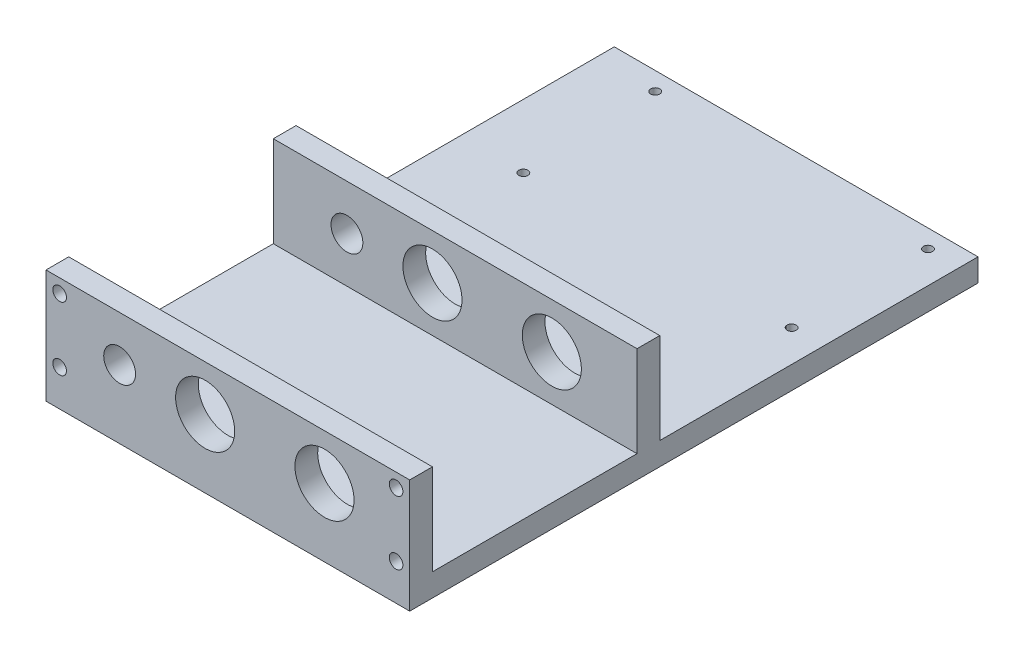
ISO-10303-21;
HEADER;
FILE_DESCRIPTION(('STEP AP214'),'2;1');
FILE_NAME('part.step','',(''),(''),'','','');
FILE_SCHEMA(('AUTOMOTIVE_DESIGN { 1 0 10303 214 1 1 1 1 }'));
ENDSEC;
DATA;
#1=APPLICATION_CONTEXT('core data for automotive mechanical design processes');
#2=APPLICATION_PROTOCOL_DEFINITION('international standard','automotive_design',2000,#1);
#3=PRODUCT_CONTEXT('',#1,'mechanical');
#4=PRODUCT('Part','Part','',(#3));
#5=PRODUCT_RELATED_PRODUCT_CATEGORY('part','',(#4));
#6=PRODUCT_DEFINITION_FORMATION('','',#4);
#7=PRODUCT_DEFINITION_CONTEXT('part definition',#1,'design');
#8=PRODUCT_DEFINITION('design','',#6,#7);
#9=PRODUCT_DEFINITION_SHAPE('','',#8);
#10=(LENGTH_UNIT() NAMED_UNIT(*) SI_UNIT(.MILLI.,.METRE.));
#11=(NAMED_UNIT(*) PLANE_ANGLE_UNIT() SI_UNIT($,.RADIAN.));
#12=(NAMED_UNIT(*) SI_UNIT($,.STERADIAN.) SOLID_ANGLE_UNIT());
#13=UNCERTAINTY_MEASURE_WITH_UNIT(LENGTH_MEASURE(1.E-05),#10,'distance_accuracy_value','');
#14=(GEOMETRIC_REPRESENTATION_CONTEXT(3) GLOBAL_UNCERTAINTY_ASSIGNED_CONTEXT((#13)) GLOBAL_UNIT_ASSIGNED_CONTEXT((#10,
#11,#12)) REPRESENTATION_CONTEXT('',''));
#15=CARTESIAN_POINT('',(0.,0.,0.));
#16=DIRECTION('',(0.,0.,1.));
#17=DIRECTION('',(1.,0.,0.));
#18=AXIS2_PLACEMENT_3D('',#15,#16,#17);
#19=CARTESIAN_POINT('',(80.,5.,-120.));
#20=DIRECTION('',(0.,-1.,0.));
#21=DIRECTION('',(0.,0.,-1.));
#22=AXIS2_PLACEMENT_3D('',#19,#20,#21);
#23=PLANE('',#22);
#24=CARTESIAN_POINT('',(13.,5.,-116.));
#25=DIRECTION('',(0.,1.,0.));
#26=DIRECTION('',(0.,0.,1.));
#27=AXIS2_PLACEMENT_3D('',#24,#25,#26);
#28=CIRCLE('',#27,1.);
#29=CARTESIAN_POINT('',(13.,5.,-115.));
#30=VERTEX_POINT('',#29);
#31=EDGE_CURVE('E463',#30,#30,#28,.T.);
#32=ORIENTED_EDGE('',*,*,#31,.F.);
#33=EDGE_LOOP('',(#32));
#34=FACE_BOUND('',#33,.T.);
#35=CARTESIAN_POINT('',(14.,5.,-86.));
#36=DIRECTION('',(0.,1.,0.));
#37=DIRECTION('',(0.,0.,1.));
#38=AXIS2_PLACEMENT_3D('',#35,#36,#37);
#39=CIRCLE('',#38,1.);
#40=CARTESIAN_POINT('',(14.,5.,-85.));
#41=VERTEX_POINT('',#40);
#42=EDGE_CURVE('E464',#41,#41,#39,.T.);
#43=ORIENTED_EDGE('',*,*,#42,.F.);
#44=EDGE_LOOP('',(#43));
#45=FACE_BOUND('',#44,.T.);
#46=CARTESIAN_POINT('',(73.,5.,-86.));
#47=DIRECTION('',(0.,1.,0.));
#48=DIRECTION('',(0.,0.,1.));
#49=AXIS2_PLACEMENT_3D('',#46,#47,#48);
#50=CIRCLE('',#49,0.999999999999998);
#51=CARTESIAN_POINT('',(73.,5.,-85.));
#52=VERTEX_POINT('',#51);
#53=EDGE_CURVE('E466',#52,#52,#50,.T.);
#54=ORIENTED_EDGE('',*,*,#53,.F.);
#55=EDGE_LOOP('',(#54));
#56=FACE_BOUND('',#55,.T.);
#57=CARTESIAN_POINT('',(73.,5.,-116.));
#58=DIRECTION('',(0.,1.,0.));
#59=DIRECTION('',(0.,0.,1.));
#60=AXIS2_PLACEMENT_3D('',#57,#58,#59);
#61=CIRCLE('',#60,0.999999999999998);
#62=CARTESIAN_POINT('',(73.,5.,-115.));
#63=VERTEX_POINT('',#62);
#64=EDGE_CURVE('E201',#63,#63,#61,.T.);
#65=ORIENTED_EDGE('',*,*,#64,.F.);
#66=EDGE_LOOP('',(#65));
#67=FACE_BOUND('',#66,.T.);
#68=DIRECTION('',(-1.,0.,0.));
#69=VECTOR('',#68,1.);
#70=CARTESIAN_POINT('',(80.,5.,-50.));
#71=LINE('',#70,#69);
#72=CARTESIAN_POINT('',(80.,5.,-50.));
#73=VERTEX_POINT('',#72);
#74=CARTESIAN_POINT('',(0.,5.,-50.));
#75=VERTEX_POINT('',#74);
#76=EDGE_CURVE('E259',#73,#75,#71,.T.);
#77=ORIENTED_EDGE('',*,*,#76,.F.);
#78=DIRECTION('',(0.,0.,1.));
#79=VECTOR('',#78,1.);
#80=CARTESIAN_POINT('',(80.,5.,-120.));
#81=LINE('',#80,#79);
#82=CARTESIAN_POINT('',(80.,5.,-120.));
#83=VERTEX_POINT('',#82);
#84=EDGE_CURVE('E136',#83,#73,#81,.T.);
#85=ORIENTED_EDGE('',*,*,#84,.F.);
#86=DIRECTION('',(1.,0.,0.));
#87=VECTOR('',#86,1.);
#88=CARTESIAN_POINT('',(80.,5.,-120.));
#89=LINE('',#88,#87);
#90=CARTESIAN_POINT('',(0.,5.,-120.));
#91=VERTEX_POINT('',#90);
#92=EDGE_CURVE('E153',#91,#83,#89,.T.);
#93=ORIENTED_EDGE('',*,*,#92,.F.);
#94=DIRECTION('',(0.,0.,1.));
#95=VECTOR('',#94,1.);
#96=CARTESIAN_POINT('',(0.,5.,-120.));
#97=LINE('',#96,#95);
#98=EDGE_CURVE('E58',#91,#75,#97,.T.);
#99=ORIENTED_EDGE('',*,*,#98,.T.);
#100=EDGE_LOOP('',(#77,#85,#93,#99));
#101=FACE_BOUND('',#100,.T.);
#102=ADVANCED_FACE('F33',(#34,#45,#56,#67,#101),#23,.F.);
#103=DIRECTION('',(1.,0.,0.));
#104=VECTOR('',#103,1.);
#105=CARTESIAN_POINT('',(0.,5.,-45.));
#106=LINE('',#105,#104);
#107=CARTESIAN_POINT('',(0.,5.,-45.));
#108=VERTEX_POINT('',#107);
#109=CARTESIAN_POINT('',(80.,5.,-45.));
#110=VERTEX_POINT('',#109);
#111=EDGE_CURVE('E50',#108,#110,#106,.T.);
#112=ORIENTED_EDGE('',*,*,#111,.F.);
#113=CARTESIAN_POINT('',(0.,5.,0.));
#114=VERTEX_POINT('',#113);
#115=EDGE_CURVE('E157',#108,#114,#97,.T.);
#116=ORIENTED_EDGE('',*,*,#115,.T.);
#117=DIRECTION('',(1.,0.,0.));
#118=VECTOR('',#117,1.);
#119=CARTESIAN_POINT('',(80.,5.,0.));
#120=LINE('',#119,#118);
#121=CARTESIAN_POINT('',(80.,5.,0.));
#122=VERTEX_POINT('',#121);
#123=EDGE_CURVE('E137',#114,#122,#120,.T.);
#124=ORIENTED_EDGE('',*,*,#123,.T.);
#125=EDGE_CURVE('E154',#110,#122,#81,.T.);
#126=ORIENTED_EDGE('',*,*,#125,.F.);
#127=EDGE_LOOP('',(#112,#116,#124,#126));
#128=FACE_BOUND('',#127,.T.);
#129=ADVANCED_FACE('F273',(#128),#23,.F.);
#130=CARTESIAN_POINT('',(0.,0.,5.));
#131=DIRECTION('',(1.,0.,0.));
#132=DIRECTION('',(0.,0.,-1.));
#133=AXIS2_PLACEMENT_3D('',#130,#131,#132);
#134=PLANE('',#133);
#135=DIRECTION('',(0.,-1.,0.));
#136=VECTOR('',#135,1.);
#137=CARTESIAN_POINT('',(0.,0.,0.));
#138=LINE('',#137,#136);
#139=CARTESIAN_POINT('',(0.,25.,0.));
#140=VERTEX_POINT('',#139);
#141=EDGE_CURVE('E159',#140,#114,#138,.T.);
#142=ORIENTED_EDGE('',*,*,#141,.T.);
#143=ORIENTED_EDGE('',*,*,#115,.F.);
#144=DIRECTION('',(0.,-1.,0.));
#145=VECTOR('',#144,1.);
#146=CARTESIAN_POINT('',(0.,25.,-45.));
#147=LINE('',#146,#145);
#148=CARTESIAN_POINT('',(0.,25.,-45.));
#149=VERTEX_POINT('',#148);
#150=EDGE_CURVE('E142',#149,#108,#147,.T.);
#151=ORIENTED_EDGE('',*,*,#150,.F.);
#152=DIRECTION('',(0.,0.,1.));
#153=VECTOR('',#152,1.);
#154=CARTESIAN_POINT('',(0.,25.,-50.));
#155=LINE('',#154,#153);
#156=CARTESIAN_POINT('',(0.,25.,-50.));
#157=VERTEX_POINT('',#156);
#158=EDGE_CURVE('E121',#157,#149,#155,.T.);
#159=ORIENTED_EDGE('',*,*,#158,.F.);
#160=DIRECTION('',(0.,-1.,0.));
#161=VECTOR('',#160,1.);
#162=CARTESIAN_POINT('',(0.,25.,-50.));
#163=LINE('',#162,#161);
#164=EDGE_CURVE('E118',#157,#75,#163,.T.);
#165=ORIENTED_EDGE('',*,*,#164,.T.);
#166=ORIENTED_EDGE('',*,*,#98,.F.);
#167=DIRECTION('',(0.,1.,0.));
#168=VECTOR('',#167,1.);
#169=CARTESIAN_POINT('',(0.,5.,-120.));
#170=LINE('',#169,#168);
#171=CARTESIAN_POINT('',(0.,0.,-120.));
#172=VERTEX_POINT('',#171);
#173=EDGE_CURVE('E151',#172,#91,#170,.T.);
#174=ORIENTED_EDGE('',*,*,#173,.F.);
#175=DIRECTION('',(0.,0.,-1.));
#176=VECTOR('',#175,1.);
#177=CARTESIAN_POINT('',(0.,0.,5.));
#178=LINE('',#177,#176);
#179=CARTESIAN_POINT('',(0.,0.,5.));
#180=VERTEX_POINT('',#179);
#181=EDGE_CURVE('E11',#180,#172,#178,.T.);
#182=ORIENTED_EDGE('',*,*,#181,.F.);
#183=DIRECTION('',(0.,-1.,0.));
#184=VECTOR('',#183,1.);
#185=CARTESIAN_POINT('',(0.,0.,5.));
#186=LINE('',#185,#184);
#187=CARTESIAN_POINT('',(0.,25.,5.));
#188=VERTEX_POINT('',#187);
#189=EDGE_CURVE('E160',#188,#180,#186,.T.);
#190=ORIENTED_EDGE('',*,*,#189,.F.);
#191=DIRECTION('',(0.,0.,-1.));
#192=VECTOR('',#191,1.);
#193=CARTESIAN_POINT('',(0.,25.,5.));
#194=LINE('',#193,#192);
#195=EDGE_CURVE('E170',#188,#140,#194,.T.);
#196=ORIENTED_EDGE('',*,*,#195,.T.);
#197=EDGE_LOOP('',(#142,#143,#151,#159,#165,#166,#174,#182,#190,#196));
#198=FACE_BOUND('',#197,.T.);
#199=ADVANCED_FACE('F35',(#198),#134,.F.);
#200=CARTESIAN_POINT('',(0.,0.,5.));
#201=DIRECTION('',(0.,1.,0.));
#202=DIRECTION('',(0.,0.,1.));
#203=AXIS2_PLACEMENT_3D('',#200,#201,#202);
#204=PLANE('',#203);
#205=CARTESIAN_POINT('',(13.,0.,-116.));
#206=DIRECTION('',(0.,1.,0.));
#207=DIRECTION('',(0.,0.,1.));
#208=AXIS2_PLACEMENT_3D('',#205,#206,#207);
#209=CIRCLE('',#208,1.);
#210=CARTESIAN_POINT('',(13.,0.,-115.));
#211=VERTEX_POINT('',#210);
#212=EDGE_CURVE('E37',#211,#211,#209,.T.);
#213=ORIENTED_EDGE('',*,*,#212,.T.);
#214=EDGE_LOOP('',(#213));
#215=FACE_BOUND('',#214,.T.);
#216=CARTESIAN_POINT('',(14.,0.,-86.));
#217=DIRECTION('',(0.,1.,0.));
#218=DIRECTION('',(0.,0.,1.));
#219=AXIS2_PLACEMENT_3D('',#216,#217,#218);
#220=CIRCLE('',#219,1.);
#221=CARTESIAN_POINT('',(14.,0.,-85.));
#222=VERTEX_POINT('',#221);
#223=EDGE_CURVE('E203',#222,#222,#220,.T.);
#224=ORIENTED_EDGE('',*,*,#223,.T.);
#225=EDGE_LOOP('',(#224));
#226=FACE_BOUND('',#225,.T.);
#227=CARTESIAN_POINT('',(73.,0.,-86.));
#228=DIRECTION('',(0.,1.,0.));
#229=DIRECTION('',(0.,0.,1.));
#230=AXIS2_PLACEMENT_3D('',#227,#228,#229);
#231=CIRCLE('',#230,0.999999999999998);
#232=CARTESIAN_POINT('',(73.,0.,-85.));
#233=VERTEX_POINT('',#232);
#234=EDGE_CURVE('E200',#233,#233,#231,.T.);
#235=ORIENTED_EDGE('',*,*,#234,.T.);
#236=EDGE_LOOP('',(#235));
#237=FACE_BOUND('',#236,.T.);
#238=CARTESIAN_POINT('',(73.,0.,-116.));
#239=DIRECTION('',(0.,1.,0.));
#240=DIRECTION('',(0.,0.,1.));
#241=AXIS2_PLACEMENT_3D('',#238,#239,#240);
#242=CIRCLE('',#241,0.999999999999998);
#243=CARTESIAN_POINT('',(73.,0.,-115.));
#244=VERTEX_POINT('',#243);
#245=EDGE_CURVE('E197',#244,#244,#242,.T.);
#246=ORIENTED_EDGE('',*,*,#245,.T.);
#247=EDGE_LOOP('',(#246));
#248=FACE_BOUND('',#247,.T.);
#249=ORIENTED_EDGE('',*,*,#181,.T.);
#250=DIRECTION('',(-1.,0.,0.));
#251=VECTOR('',#250,1.);
#252=CARTESIAN_POINT('',(80.,0.,-120.));
#253=LINE('',#252,#251);
#254=CARTESIAN_POINT('',(80.,0.,-120.));
#255=VERTEX_POINT('',#254);
#256=EDGE_CURVE('E148',#255,#172,#253,.T.);
#257=ORIENTED_EDGE('',*,*,#256,.F.);
#258=DIRECTION('',(0.,0.,-1.));
#259=VECTOR('',#258,1.);
#260=CARTESIAN_POINT('',(80.,0.,5.));
#261=LINE('',#260,#259);
#262=CARTESIAN_POINT('',(80.,0.,5.));
#263=VERTEX_POINT('',#262);
#264=EDGE_CURVE('E42',#263,#255,#261,.T.);
#265=ORIENTED_EDGE('',*,*,#264,.F.);
#266=DIRECTION('',(1.,0.,0.));
#267=VECTOR('',#266,1.);
#268=CARTESIAN_POINT('',(0.,0.,5.));
#269=LINE('',#268,#267);
#270=EDGE_CURVE('E163',#180,#263,#269,.T.);
#271=ORIENTED_EDGE('',*,*,#270,.F.);
#272=EDGE_LOOP('',(#249,#257,#265,#271));
#273=FACE_BOUND('',#272,.T.);
#274=ADVANCED_FACE('F291',(#215,#226,#237,#248,#273),#204,.F.);
#275=CARTESIAN_POINT('',(80.,0.,5.));
#276=DIRECTION('',(-1.,0.,0.));
#277=DIRECTION('',(0.,0.,1.));
#278=AXIS2_PLACEMENT_3D('',#275,#276,#277);
#279=PLANE('',#278);
#280=ORIENTED_EDGE('',*,*,#264,.T.);
#281=DIRECTION('',(0.,-1.,0.));
#282=VECTOR('',#281,1.);
#283=CARTESIAN_POINT('',(80.,5.,-120.));
#284=LINE('',#283,#282);
#285=EDGE_CURVE('E140',#83,#255,#284,.T.);
#286=ORIENTED_EDGE('',*,*,#285,.F.);
#287=ORIENTED_EDGE('',*,*,#84,.T.);
#288=DIRECTION('',(0.,-1.,0.));
#289=VECTOR('',#288,1.);
#290=CARTESIAN_POINT('',(80.,25.,-50.));
#291=LINE('',#290,#289);
#292=CARTESIAN_POINT('',(80.,25.,-50.));
#293=VERTEX_POINT('',#292);
#294=EDGE_CURVE('E116',#293,#73,#291,.T.);
#295=ORIENTED_EDGE('',*,*,#294,.F.);
#296=DIRECTION('',(0.,0.,-1.));
#297=VECTOR('',#296,1.);
#298=CARTESIAN_POINT('',(80.,25.,-45.));
#299=LINE('',#298,#297);
#300=CARTESIAN_POINT('',(80.,25.,-45.));
#301=VERTEX_POINT('',#300);
#302=EDGE_CURVE('E122',#301,#293,#299,.T.);
#303=ORIENTED_EDGE('',*,*,#302,.F.);
#304=DIRECTION('',(0.,-1.,0.));
#305=VECTOR('',#304,1.);
#306=CARTESIAN_POINT('',(80.,25.,-45.));
#307=LINE('',#306,#305);
#308=EDGE_CURVE('E263',#301,#110,#307,.T.);
#309=ORIENTED_EDGE('',*,*,#308,.T.);
#310=ORIENTED_EDGE('',*,*,#125,.T.);
#311=DIRECTION('',(0.,1.,0.));
#312=VECTOR('',#311,1.);
#313=CARTESIAN_POINT('',(80.,0.,0.));
#314=LINE('',#313,#312);
#315=CARTESIAN_POINT('',(80.,25.,0.));
#316=VERTEX_POINT('',#315);
#317=EDGE_CURVE('E173',#122,#316,#314,.T.);
#318=ORIENTED_EDGE('',*,*,#317,.T.);
#319=DIRECTION('',(0.,0.,-1.));
#320=VECTOR('',#319,1.);
#321=CARTESIAN_POINT('',(80.,25.,5.));
#322=LINE('',#321,#320);
#323=CARTESIAN_POINT('',(80.,25.,5.));
#324=VERTEX_POINT('',#323);
#325=EDGE_CURVE('E178',#324,#316,#322,.T.);
#326=ORIENTED_EDGE('',*,*,#325,.F.);
#327=DIRECTION('',(0.,1.,0.));
#328=VECTOR('',#327,1.);
#329=CARTESIAN_POINT('',(80.,0.,5.));
#330=LINE('',#329,#328);
#331=EDGE_CURVE('E166',#263,#324,#330,.T.);
#332=ORIENTED_EDGE('',*,*,#331,.F.);
#333=EDGE_LOOP('',(#280,#286,#287,#295,#303,#309,#310,#318,#326,#332));
#334=FACE_BOUND('',#333,.T.);
#335=ADVANCED_FACE('F133',(#334),#279,.F.);
#336=CARTESIAN_POINT('',(0.,25.,5.));
#337=DIRECTION('',(0.,-1.,0.));
#338=DIRECTION('',(0.,0.,-1.));
#339=AXIS2_PLACEMENT_3D('',#336,#337,#338);
#340=PLANE('',#339);
#341=DIRECTION('',(-1.,0.,0.));
#342=VECTOR('',#341,1.);
#343=CARTESIAN_POINT('',(0.,25.,0.));
#344=LINE('',#343,#342);
#345=EDGE_CURVE('E164',#316,#140,#344,.T.);
#346=ORIENTED_EDGE('',*,*,#345,.T.);
#347=ORIENTED_EDGE('',*,*,#195,.F.);
#348=DIRECTION('',(-1.,0.,0.));
#349=VECTOR('',#348,1.);
#350=CARTESIAN_POINT('',(0.,25.,5.));
#351=LINE('',#350,#349);
#352=EDGE_CURVE('E168',#324,#188,#351,.T.);
#353=ORIENTED_EDGE('',*,*,#352,.F.);
#354=ORIENTED_EDGE('',*,*,#325,.T.);
#355=EDGE_LOOP('',(#346,#347,#353,#354));
#356=FACE_BOUND('',#355,.T.);
#357=ADVANCED_FACE('F282',(#356),#340,.F.);
#358=CARTESIAN_POINT('',(0.,0.,5.));
#359=DIRECTION('',(0.,0.,-1.));
#360=DIRECTION('',(-1.,0.,0.));
#361=AXIS2_PLACEMENT_3D('',#358,#359,#360);
#362=PLANE('',#361);
#363=CARTESIAN_POINT('',(16.1918061123885,15.,5.));
#364=DIRECTION('',(0.,0.,-1.));
#365=DIRECTION('',(-1.,0.,0.));
#366=AXIS2_PLACEMENT_3D('',#363,#364,#365);
#367=CIRCLE('',#366,3.5);
#368=CARTESIAN_POINT('',(12.6918061123885,15.,5.));
#369=VERTEX_POINT('',#368);
#370=EDGE_CURVE('E196',#369,#369,#367,.T.);
#371=ORIENTED_EDGE('',*,*,#370,.T.);
#372=EDGE_LOOP('',(#371));
#373=FACE_BOUND('',#372,.T.);
#374=CARTESIAN_POINT('',(61.2583245324458,15.,5.));
#375=DIRECTION('',(0.,0.,-1.));
#376=DIRECTION('',(-1.,0.,0.));
#377=AXIS2_PLACEMENT_3D('',#374,#375,#376);
#378=CIRCLE('',#377,6.5);
#379=CARTESIAN_POINT('',(54.7583245324458,15.,5.));
#380=VERTEX_POINT('',#379);
#381=EDGE_CURVE('E186',#380,#380,#378,.T.);
#382=ORIENTED_EDGE('',*,*,#381,.T.);
#383=EDGE_LOOP('',(#382));
#384=FACE_BOUND('',#383,.T.);
#385=CARTESIAN_POINT('',(35.004725497032,15.,5.));
#386=DIRECTION('',(0.,0.,-1.));
#387=DIRECTION('',(-1.,0.,0.));
#388=AXIS2_PLACEMENT_3D('',#385,#386,#387);
#389=CIRCLE('',#388,6.5);
#390=CARTESIAN_POINT('',(28.504725497032,15.,5.));
#391=VERTEX_POINT('',#390);
#392=EDGE_CURVE('E222',#391,#391,#389,.T.);
#393=ORIENTED_EDGE('',*,*,#392,.T.);
#394=EDGE_LOOP('',(#393));
#395=FACE_BOUND('',#394,.T.);
#396=CARTESIAN_POINT('',(77.,8.,5.));
#397=DIRECTION('',(0.,0.,-1.));
#398=DIRECTION('',(-1.,0.,0.));
#399=AXIS2_PLACEMENT_3D('',#396,#397,#398);
#400=CIRCLE('',#399,1.5);
#401=CARTESIAN_POINT('',(75.5,8.,5.));
#402=VERTEX_POINT('',#401);
#403=EDGE_CURVE('E257',#402,#402,#400,.T.);
#404=ORIENTED_EDGE('',*,*,#403,.T.);
#405=EDGE_LOOP('',(#404));
#406=FACE_BOUND('',#405,.T.);
#407=CARTESIAN_POINT('',(3.,22.,5.));
#408=DIRECTION('',(0.,0.,-1.));
#409=DIRECTION('',(-1.,0.,0.));
#410=AXIS2_PLACEMENT_3D('',#407,#408,#409);
#411=CIRCLE('',#410,1.5);
#412=CARTESIAN_POINT('',(1.50000000000001,22.,5.));
#413=VERTEX_POINT('',#412);
#414=EDGE_CURVE('E254',#413,#413,#411,.T.);
#415=ORIENTED_EDGE('',*,*,#414,.T.);
#416=EDGE_LOOP('',(#415));
#417=FACE_BOUND('',#416,.T.);
#418=CARTESIAN_POINT('',(3.,8.,5.));
#419=DIRECTION('',(0.,0.,-1.));
#420=DIRECTION('',(-1.,0.,0.));
#421=AXIS2_PLACEMENT_3D('',#418,#419,#420);
#422=CIRCLE('',#421,1.5);
#423=CARTESIAN_POINT('',(1.50000000000001,8.,5.));
#424=VERTEX_POINT('',#423);
#425=EDGE_CURVE('E251',#424,#424,#422,.T.);
#426=ORIENTED_EDGE('',*,*,#425,.T.);
#427=EDGE_LOOP('',(#426));
#428=FACE_BOUND('',#427,.T.);
#429=CARTESIAN_POINT('',(77.,22.,5.));
#430=DIRECTION('',(0.,0.,-1.));
#431=DIRECTION('',(-1.,0.,0.));
#432=AXIS2_PLACEMENT_3D('',#429,#430,#431);
#433=CIRCLE('',#432,1.5);
#434=CARTESIAN_POINT('',(75.5,22.,5.));
#435=VERTEX_POINT('',#434);
#436=EDGE_CURVE('E248',#435,#435,#433,.T.);
#437=ORIENTED_EDGE('',*,*,#436,.T.);
#438=EDGE_LOOP('',(#437));
#439=FACE_BOUND('',#438,.T.);
#440=ORIENTED_EDGE('',*,*,#189,.T.);
#441=ORIENTED_EDGE('',*,*,#270,.T.);
#442=ORIENTED_EDGE('',*,*,#331,.T.);
#443=ORIENTED_EDGE('',*,*,#352,.T.);
#444=EDGE_LOOP('',(#440,#441,#442,#443));
#445=FACE_BOUND('',#444,.T.);
#446=ADVANCED_FACE('F286',(#373,#384,#395,#406,#417,#428,#439,#445),#362,.F.);
#447=CARTESIAN_POINT('',(0.,0.,0.));
#448=DIRECTION('',(0.,0.,-1.));
#449=DIRECTION('',(-1.,0.,0.));
#450=AXIS2_PLACEMENT_3D('',#447,#448,#449);
#451=PLANE('',#450);
#452=CARTESIAN_POINT('',(16.1918061123885,15.,0.));
#453=DIRECTION('',(0.,0.,-1.));
#454=DIRECTION('',(-1.,0.,0.));
#455=AXIS2_PLACEMENT_3D('',#452,#453,#454);
#456=CIRCLE('',#455,3.5);
#457=CARTESIAN_POINT('',(12.6918061123885,15.,0.));
#458=VERTEX_POINT('',#457);
#459=EDGE_CURVE('E219',#458,#458,#456,.T.);
#460=ORIENTED_EDGE('',*,*,#459,.F.);
#461=EDGE_LOOP('',(#460));
#462=FACE_BOUND('',#461,.T.);
#463=CARTESIAN_POINT('',(61.2583245324458,15.,0.));
#464=DIRECTION('',(0.,0.,-1.));
#465=DIRECTION('',(-1.,0.,0.));
#466=AXIS2_PLACEMENT_3D('',#463,#464,#465);
#467=CIRCLE('',#466,6.5);
#468=CARTESIAN_POINT('',(54.7583245324458,15.,0.));
#469=VERTEX_POINT('',#468);
#470=EDGE_CURVE('E233',#469,#469,#467,.T.);
#471=ORIENTED_EDGE('',*,*,#470,.F.);
#472=EDGE_LOOP('',(#471));
#473=FACE_BOUND('',#472,.T.);
#474=CARTESIAN_POINT('',(35.004725497032,15.,0.));
#475=DIRECTION('',(0.,0.,-1.));
#476=DIRECTION('',(-1.,0.,0.));
#477=AXIS2_PLACEMENT_3D('',#474,#475,#476);
#478=CIRCLE('',#477,6.5);
#479=CARTESIAN_POINT('',(28.504725497032,15.,0.));
#480=VERTEX_POINT('',#479);
#481=EDGE_CURVE('E191',#480,#480,#478,.T.);
#482=ORIENTED_EDGE('',*,*,#481,.F.);
#483=EDGE_LOOP('',(#482));
#484=FACE_BOUND('',#483,.T.);
#485=CARTESIAN_POINT('',(77.,8.,0.));
#486=DIRECTION('',(0.,0.,-1.));
#487=DIRECTION('',(1.,0.,0.));
#488=AXIS2_PLACEMENT_3D('',#485,#486,#487);
#489=CIRCLE('',#488,1.5);
#490=CARTESIAN_POINT('',(78.5,8.,0.));
#491=VERTEX_POINT('',#490);
#492=EDGE_CURVE('E240',#491,#491,#489,.T.);
#493=ORIENTED_EDGE('',*,*,#492,.F.);
#494=EDGE_LOOP('',(#493));
#495=FACE_BOUND('',#494,.T.);
#496=CARTESIAN_POINT('',(3.,22.,0.));
#497=DIRECTION('',(0.,0.,-1.));
#498=DIRECTION('',(1.,0.,0.));
#499=AXIS2_PLACEMENT_3D('',#496,#497,#498);
#500=CIRCLE('',#499,1.5);
#501=CARTESIAN_POINT('',(4.5,22.,0.));
#502=VERTEX_POINT('',#501);
#503=EDGE_CURVE('E239',#502,#502,#500,.T.);
#504=ORIENTED_EDGE('',*,*,#503,.F.);
#505=EDGE_LOOP('',(#504));
#506=FACE_BOUND('',#505,.T.);
#507=CARTESIAN_POINT('',(3.,8.,0.));
#508=DIRECTION('',(0.,0.,-1.));
#509=DIRECTION('',(-1.,0.,0.));
#510=AXIS2_PLACEMENT_3D('',#507,#508,#509);
#511=CIRCLE('',#510,1.5);
#512=CARTESIAN_POINT('',(1.50000000000001,8.,0.));
#513=VERTEX_POINT('',#512);
#514=EDGE_CURVE('E236',#513,#513,#511,.T.);
#515=ORIENTED_EDGE('',*,*,#514,.F.);
#516=EDGE_LOOP('',(#515));
#517=FACE_BOUND('',#516,.T.);
#518=CARTESIAN_POINT('',(77.,22.,0.));
#519=DIRECTION('',(0.,0.,-1.));
#520=DIRECTION('',(-1.,0.,0.));
#521=AXIS2_PLACEMENT_3D('',#518,#519,#520);
#522=CIRCLE('',#521,1.5);
#523=CARTESIAN_POINT('',(75.5,22.,0.));
#524=VERTEX_POINT('',#523);
#525=EDGE_CURVE('E243',#524,#524,#522,.T.);
#526=ORIENTED_EDGE('',*,*,#525,.F.);
#527=EDGE_LOOP('',(#526));
#528=FACE_BOUND('',#527,.T.);
#529=ORIENTED_EDGE('',*,*,#123,.F.);
#530=ORIENTED_EDGE('',*,*,#141,.F.);
#531=ORIENTED_EDGE('',*,*,#345,.F.);
#532=ORIENTED_EDGE('',*,*,#317,.F.);
#533=EDGE_LOOP('',(#529,#530,#531,#532));
#534=FACE_BOUND('',#533,.T.);
#535=ADVANCED_FACE('F276',(#462,#473,#484,#495,#506,#517,#528,#534),#451,.T.);
#536=CARTESIAN_POINT('',(0.,0.,-120.));
#537=DIRECTION('',(0.,0.,-1.));
#538=DIRECTION('',(-1.,0.,0.));
#539=AXIS2_PLACEMENT_3D('',#536,#537,#538);
#540=PLANE('',#539);
#541=ORIENTED_EDGE('',*,*,#285,.T.);
#542=ORIENTED_EDGE('',*,*,#256,.T.);
#543=ORIENTED_EDGE('',*,*,#173,.T.);
#544=ORIENTED_EDGE('',*,*,#92,.T.);
#545=EDGE_LOOP('',(#541,#542,#543,#544));
#546=FACE_BOUND('',#545,.T.);
#547=ADVANCED_FACE('F294',(#546),#540,.T.);
#548=CARTESIAN_POINT('',(80.,25.,-50.));
#549=DIRECTION('',(0.,0.,1.));
#550=DIRECTION('',(1.,0.,0.));
#551=AXIS2_PLACEMENT_3D('',#548,#549,#550);
#552=PLANE('',#551);
#553=CARTESIAN_POINT('',(16.1918061123885,15.,-50.));
#554=DIRECTION('',(0.,0.,1.));
#555=DIRECTION('',(1.,0.,0.));
#556=AXIS2_PLACEMENT_3D('',#553,#554,#555);
#557=CIRCLE('',#556,3.5);
#558=CARTESIAN_POINT('',(19.6918061123885,15.,-50.));
#559=VERTEX_POINT('',#558);
#560=EDGE_CURVE('E195',#559,#559,#557,.T.);
#561=ORIENTED_EDGE('',*,*,#560,.T.);
#562=EDGE_LOOP('',(#561));
#563=FACE_BOUND('',#562,.T.);
#564=CARTESIAN_POINT('',(61.2583245324458,15.,-50.));
#565=DIRECTION('',(0.,0.,1.));
#566=DIRECTION('',(1.,0.,0.));
#567=AXIS2_PLACEMENT_3D('',#564,#565,#566);
#568=CIRCLE('',#567,6.5);
#569=CARTESIAN_POINT('',(67.7583245324458,15.,-50.));
#570=VERTEX_POINT('',#569);
#571=EDGE_CURVE('E190',#570,#570,#568,.T.);
#572=ORIENTED_EDGE('',*,*,#571,.T.);
#573=EDGE_LOOP('',(#572));
#574=FACE_BOUND('',#573,.T.);
#575=CARTESIAN_POINT('',(35.004725497032,15.,-50.));
#576=DIRECTION('',(0.,0.,1.));
#577=DIRECTION('',(1.,0.,0.));
#578=AXIS2_PLACEMENT_3D('',#575,#576,#577);
#579=CIRCLE('',#578,6.5);
#580=CARTESIAN_POINT('',(41.504725497032,15.,-50.));
#581=VERTEX_POINT('',#580);
#582=EDGE_CURVE('E185',#581,#581,#579,.T.);
#583=ORIENTED_EDGE('',*,*,#582,.T.);
#584=EDGE_LOOP('',(#583));
#585=FACE_BOUND('',#584,.T.);
#586=ORIENTED_EDGE('',*,*,#76,.T.);
#587=ORIENTED_EDGE('',*,*,#164,.F.);
#588=DIRECTION('',(-1.,0.,0.));
#589=VECTOR('',#588,1.);
#590=CARTESIAN_POINT('',(80.,25.,-50.));
#591=LINE('',#590,#589);
#592=EDGE_CURVE('E112',#293,#157,#591,.T.);
#593=ORIENTED_EDGE('',*,*,#592,.F.);
#594=ORIENTED_EDGE('',*,*,#294,.T.);
#595=EDGE_LOOP('',(#586,#587,#593,#594));
#596=FACE_BOUND('',#595,.T.);
#597=ADVANCED_FACE('F114',(#563,#574,#585,#596),#552,.F.);
#598=CARTESIAN_POINT('',(0.,25.,-45.));
#599=DIRECTION('',(0.,0.,-1.));
#600=DIRECTION('',(-1.,0.,0.));
#601=AXIS2_PLACEMENT_3D('',#598,#599,#600);
#602=PLANE('',#601);
#603=CARTESIAN_POINT('',(16.1918061123885,15.,-45.));
#604=DIRECTION('',(0.,0.,-1.));
#605=DIRECTION('',(-1.,0.,0.));
#606=AXIS2_PLACEMENT_3D('',#603,#604,#605);
#607=CIRCLE('',#606,3.5);
#608=CARTESIAN_POINT('',(12.6918061123885,15.,-45.));
#609=VERTEX_POINT('',#608);
#610=EDGE_CURVE('E192',#609,#609,#607,.T.);
#611=ORIENTED_EDGE('',*,*,#610,.T.);
#612=EDGE_LOOP('',(#611));
#613=FACE_BOUND('',#612,.T.);
#614=CARTESIAN_POINT('',(61.2583245324458,15.,-45.));
#615=DIRECTION('',(0.,0.,-1.));
#616=DIRECTION('',(-1.,0.,0.));
#617=AXIS2_PLACEMENT_3D('',#614,#615,#616);
#618=CIRCLE('',#617,6.5);
#619=CARTESIAN_POINT('',(54.7583245324458,15.,-45.));
#620=VERTEX_POINT('',#619);
#621=EDGE_CURVE('E187',#620,#620,#618,.T.);
#622=ORIENTED_EDGE('',*,*,#621,.T.);
#623=EDGE_LOOP('',(#622));
#624=FACE_BOUND('',#623,.T.);
#625=CARTESIAN_POINT('',(35.004725497032,15.,-45.));
#626=DIRECTION('',(0.,0.,-1.));
#627=DIRECTION('',(-1.,0.,0.));
#628=AXIS2_PLACEMENT_3D('',#625,#626,#627);
#629=CIRCLE('',#628,6.5);
#630=CARTESIAN_POINT('',(28.504725497032,15.,-45.));
#631=VERTEX_POINT('',#630);
#632=EDGE_CURVE('E182',#631,#631,#629,.T.);
#633=ORIENTED_EDGE('',*,*,#632,.T.);
#634=EDGE_LOOP('',(#633));
#635=FACE_BOUND('',#634,.T.);
#636=ORIENTED_EDGE('',*,*,#111,.T.);
#637=ORIENTED_EDGE('',*,*,#308,.F.);
#638=DIRECTION('',(1.,0.,0.));
#639=VECTOR('',#638,1.);
#640=CARTESIAN_POINT('',(0.,25.,-45.));
#641=LINE('',#640,#639);
#642=EDGE_CURVE('E127',#149,#301,#641,.T.);
#643=ORIENTED_EDGE('',*,*,#642,.F.);
#644=ORIENTED_EDGE('',*,*,#150,.T.);
#645=EDGE_LOOP('',(#636,#637,#643,#644));
#646=FACE_BOUND('',#645,.T.);
#647=ADVANCED_FACE('F269',(#613,#624,#635,#646),#602,.F.);
#648=CARTESIAN_POINT('',(0.,25.,0.));
#649=DIRECTION('',(0.,1.,0.));
#650=DIRECTION('',(0.,0.,1.));
#651=AXIS2_PLACEMENT_3D('',#648,#649,#650);
#652=PLANE('',#651);
#653=ORIENTED_EDGE('',*,*,#302,.T.);
#654=ORIENTED_EDGE('',*,*,#592,.T.);
#655=ORIENTED_EDGE('',*,*,#158,.T.);
#656=ORIENTED_EDGE('',*,*,#642,.T.);
#657=EDGE_LOOP('',(#653,#654,#655,#656));
#658=FACE_BOUND('',#657,.T.);
#659=ADVANCED_FACE('F125',(#658),#652,.T.);
#660=CARTESIAN_POINT('',(77.,22.,20.));
#661=DIRECTION('',(0.,0.,-1.));
#662=DIRECTION('',(-1.,0.,0.));
#663=AXIS2_PLACEMENT_3D('',#660,#661,#662);
#664=CYLINDRICAL_SURFACE('',#663,1.5);
#665=ORIENTED_EDGE('',*,*,#525,.T.);
#666=EDGE_LOOP('',(#665));
#667=FACE_BOUND('',#666,.T.);
#668=ORIENTED_EDGE('',*,*,#436,.F.);
#669=EDGE_LOOP('',(#668));
#670=FACE_BOUND('',#669,.T.);
#671=ADVANCED_FACE('F358',(#667,#670),#664,.F.);
#672=CARTESIAN_POINT('',(3.,8.,20.));
#673=DIRECTION('',(0.,0.,-1.));
#674=DIRECTION('',(-1.,0.,0.));
#675=AXIS2_PLACEMENT_3D('',#672,#673,#674);
#676=CYLINDRICAL_SURFACE('',#675,1.5);
#677=ORIENTED_EDGE('',*,*,#514,.T.);
#678=EDGE_LOOP('',(#677));
#679=FACE_BOUND('',#678,.T.);
#680=ORIENTED_EDGE('',*,*,#425,.F.);
#681=EDGE_LOOP('',(#680));
#682=FACE_BOUND('',#681,.T.);
#683=ADVANCED_FACE('F354',(#679,#682),#676,.F.);
#684=CARTESIAN_POINT('',(3.,22.,20.));
#685=DIRECTION('',(0.,0.,-1.));
#686=DIRECTION('',(-1.,0.,0.));
#687=AXIS2_PLACEMENT_3D('',#684,#685,#686);
#688=CYLINDRICAL_SURFACE('',#687,1.5);
#689=ORIENTED_EDGE('',*,*,#503,.T.);
#690=EDGE_LOOP('',(#689));
#691=FACE_BOUND('',#690,.T.);
#692=ORIENTED_EDGE('',*,*,#414,.F.);
#693=EDGE_LOOP('',(#692));
#694=FACE_BOUND('',#693,.T.);
#695=ADVANCED_FACE('F357',(#691,#694),#688,.F.);
#696=CARTESIAN_POINT('',(77.,8.,20.));
#697=DIRECTION('',(0.,0.,-1.));
#698=DIRECTION('',(-1.,0.,0.));
#699=AXIS2_PLACEMENT_3D('',#696,#697,#698);
#700=CYLINDRICAL_SURFACE('',#699,1.5);
#701=ORIENTED_EDGE('',*,*,#492,.T.);
#702=EDGE_LOOP('',(#701));
#703=FACE_BOUND('',#702,.T.);
#704=ORIENTED_EDGE('',*,*,#403,.F.);
#705=EDGE_LOOP('',(#704));
#706=FACE_BOUND('',#705,.T.);
#707=ADVANCED_FACE('F360',(#703,#706),#700,.F.);
#708=CARTESIAN_POINT('',(35.004725497032,15.,5.));
#709=DIRECTION('',(0.,0.,-1.));
#710=DIRECTION('',(-1.,0.,0.));
#711=AXIS2_PLACEMENT_3D('',#708,#709,#710);
#712=CYLINDRICAL_SURFACE('',#711,6.5);
#713=ORIENTED_EDGE('',*,*,#632,.F.);
#714=EDGE_LOOP('',(#713));
#715=FACE_BOUND('',#714,.T.);
#716=ORIENTED_EDGE('',*,*,#582,.F.);
#717=EDGE_LOOP('',(#716));
#718=FACE_BOUND('',#717,.T.);
#719=ADVANCED_FACE('F353',(#715,#718),#712,.F.);
#720=CARTESIAN_POINT('',(61.2583245324458,15.,5.));
#721=DIRECTION('',(0.,0.,-1.));
#722=DIRECTION('',(-1.,0.,0.));
#723=AXIS2_PLACEMENT_3D('',#720,#721,#722);
#724=CYLINDRICAL_SURFACE('',#723,6.5);
#725=ORIENTED_EDGE('',*,*,#621,.F.);
#726=EDGE_LOOP('',(#725));
#727=FACE_BOUND('',#726,.T.);
#728=ORIENTED_EDGE('',*,*,#571,.F.);
#729=EDGE_LOOP('',(#728));
#730=FACE_BOUND('',#729,.T.);
#731=ADVANCED_FACE('F349',(#727,#730),#724,.F.);
#732=ORIENTED_EDGE('',*,*,#481,.T.);
#733=EDGE_LOOP('',(#732));
#734=FACE_BOUND('',#733,.T.);
#735=ORIENTED_EDGE('',*,*,#392,.F.);
#736=EDGE_LOOP('',(#735));
#737=FACE_BOUND('',#736,.T.);
#738=ADVANCED_FACE('F347',(#734,#737),#712,.F.);
#739=ORIENTED_EDGE('',*,*,#470,.T.);
#740=EDGE_LOOP('',(#739));
#741=FACE_BOUND('',#740,.T.);
#742=ORIENTED_EDGE('',*,*,#381,.F.);
#743=EDGE_LOOP('',(#742));
#744=FACE_BOUND('',#743,.T.);
#745=ADVANCED_FACE('F344',(#741,#744),#724,.F.);
#746=CARTESIAN_POINT('',(16.1918061123885,15.,5.));
#747=DIRECTION('',(0.,0.,-1.));
#748=DIRECTION('',(-1.,0.,0.));
#749=AXIS2_PLACEMENT_3D('',#746,#747,#748);
#750=CYLINDRICAL_SURFACE('',#749,3.5);
#751=ORIENTED_EDGE('',*,*,#610,.F.);
#752=EDGE_LOOP('',(#751));
#753=FACE_BOUND('',#752,.T.);
#754=ORIENTED_EDGE('',*,*,#560,.F.);
#755=EDGE_LOOP('',(#754));
#756=FACE_BOUND('',#755,.T.);
#757=ADVANCED_FACE('F336',(#753,#756),#750,.F.);
#758=ORIENTED_EDGE('',*,*,#459,.T.);
#759=EDGE_LOOP('',(#758));
#760=FACE_BOUND('',#759,.T.);
#761=ORIENTED_EDGE('',*,*,#370,.F.);
#762=EDGE_LOOP('',(#761));
#763=FACE_BOUND('',#762,.T.);
#764=ADVANCED_FACE('F326',(#760,#763),#750,.F.);
#765=CARTESIAN_POINT('',(73.,-15.,-116.));
#766=DIRECTION('',(0.,1.,0.));
#767=DIRECTION('',(0.,0.,1.));
#768=AXIS2_PLACEMENT_3D('',#765,#766,#767);
#769=CYLINDRICAL_SURFACE('',#768,0.999999999999998);
#770=ORIENTED_EDGE('',*,*,#64,.T.);
#771=EDGE_LOOP('',(#770));
#772=FACE_BOUND('',#771,.T.);
#773=ORIENTED_EDGE('',*,*,#245,.F.);
#774=EDGE_LOOP('',(#773));
#775=FACE_BOUND('',#774,.T.);
#776=ADVANCED_FACE('F323',(#772,#775),#769,.F.);
#777=CARTESIAN_POINT('',(73.,-15.,-86.));
#778=DIRECTION('',(0.,1.,0.));
#779=DIRECTION('',(0.,0.,1.));
#780=AXIS2_PLACEMENT_3D('',#777,#778,#779);
#781=CYLINDRICAL_SURFACE('',#780,0.999999999999998);
#782=ORIENTED_EDGE('',*,*,#53,.T.);
#783=EDGE_LOOP('',(#782));
#784=FACE_BOUND('',#783,.T.);
#785=ORIENTED_EDGE('',*,*,#234,.F.);
#786=EDGE_LOOP('',(#785));
#787=FACE_BOUND('',#786,.T.);
#788=ADVANCED_FACE('F325',(#784,#787),#781,.F.);
#789=CARTESIAN_POINT('',(14.,-15.,-86.));
#790=DIRECTION('',(0.,1.,0.));
#791=DIRECTION('',(0.,0.,1.));
#792=AXIS2_PLACEMENT_3D('',#789,#790,#791);
#793=CYLINDRICAL_SURFACE('',#792,1.);
#794=ORIENTED_EDGE('',*,*,#42,.T.);
#795=EDGE_LOOP('',(#794));
#796=FACE_BOUND('',#795,.T.);
#797=ORIENTED_EDGE('',*,*,#223,.F.);
#798=EDGE_LOOP('',(#797));
#799=FACE_BOUND('',#798,.T.);
#800=ADVANCED_FACE('F333',(#796,#799),#793,.F.);
#801=CARTESIAN_POINT('',(13.,-15.,-116.));
#802=DIRECTION('',(0.,1.,0.));
#803=DIRECTION('',(0.,0.,1.));
#804=AXIS2_PLACEMENT_3D('',#801,#802,#803);
#805=CYLINDRICAL_SURFACE('',#804,1.);
#806=ORIENTED_EDGE('',*,*,#31,.T.);
#807=EDGE_LOOP('',(#806));
#808=FACE_BOUND('',#807,.T.);
#809=ORIENTED_EDGE('',*,*,#212,.F.);
#810=EDGE_LOOP('',(#809));
#811=FACE_BOUND('',#810,.T.);
#812=ADVANCED_FACE('F341',(#808,#811),#805,.F.);
#813=CLOSED_SHELL('',(#102,#129,#199,#274,#335,#357,#446,#535,#547,#597,#647,#659,#671,#683,
#695,#707,#719,#731,#738,#745,#757,#764,#776,#788,#800,#812));
#814=MANIFOLD_SOLID_BREP('B2',#813);
#815=ADVANCED_BREP_SHAPE_REPRESENTATION('',(#18,#814),#14);
#816=SHAPE_DEFINITION_REPRESENTATION(#9,#815);
ENDSEC;
END-ISO-10303-21;
